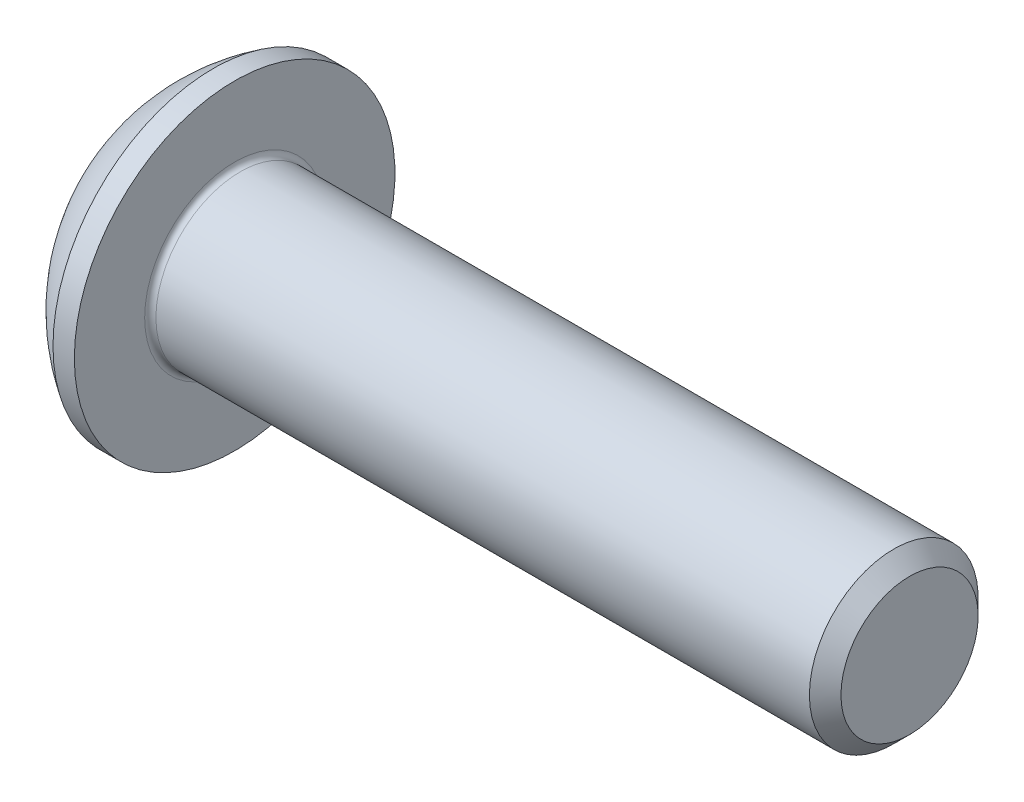
ISO-10303-21;
HEADER;
FILE_DESCRIPTION(('STEP AP214'),'2;1');
FILE_NAME('part.step','',(''),(''),'','','');
FILE_SCHEMA(('AUTOMOTIVE_DESIGN { 1 0 10303 214 1 1 1 1 }'));
ENDSEC;
DATA;
#1=APPLICATION_CONTEXT('core data for automotive mechanical design processes');
#2=APPLICATION_PROTOCOL_DEFINITION('international standard','automotive_design',2000,#1);
#3=PRODUCT_CONTEXT('',#1,'mechanical');
#4=PRODUCT('Part','Part','',(#3));
#5=PRODUCT_RELATED_PRODUCT_CATEGORY('part','',(#4));
#6=PRODUCT_DEFINITION_FORMATION('','',#4);
#7=PRODUCT_DEFINITION_CONTEXT('part definition',#1,'design');
#8=PRODUCT_DEFINITION('design','',#6,#7);
#9=PRODUCT_DEFINITION_SHAPE('','',#8);
#10=(LENGTH_UNIT() NAMED_UNIT(*) SI_UNIT(.MILLI.,.METRE.));
#11=(NAMED_UNIT(*) PLANE_ANGLE_UNIT() SI_UNIT($,.RADIAN.));
#12=(NAMED_UNIT(*) SI_UNIT($,.STERADIAN.) SOLID_ANGLE_UNIT());
#13=UNCERTAINTY_MEASURE_WITH_UNIT(LENGTH_MEASURE(1.E-05),#10,'distance_accuracy_value','');
#14=(GEOMETRIC_REPRESENTATION_CONTEXT(3) GLOBAL_UNCERTAINTY_ASSIGNED_CONTEXT((#13)) GLOBAL_UNIT_ASSIGNED_CONTEXT((#10,
#11,#12)) REPRESENTATION_CONTEXT('',''));
#15=CARTESIAN_POINT('',(0.,0.,0.));
#16=DIRECTION('',(0.,0.,1.));
#17=DIRECTION('',(1.,0.,0.));
#18=AXIS2_PLACEMENT_3D('',#15,#16,#17);
#19=CARTESIAN_POINT('',(0.,0.,0.));
#20=DIRECTION('',(-1.,0.,0.));
#21=DIRECTION('',(0.,0.,1.));
#22=AXIS2_PLACEMENT_3D('',#19,#20,#21);
#23=PLANE('',#22);
#24=CARTESIAN_POINT('',(0.,0.,0.));
#25=DIRECTION('',(-1.,0.,0.));
#26=DIRECTION('',(0.,0.,1.));
#27=AXIS2_PLACEMENT_3D('',#24,#25,#26);
#28=CIRCLE('',#27,1.425);
#29=CARTESIAN_POINT('',(0.,0.,1.425));
#30=VERTEX_POINT('',#29);
#31=EDGE_CURVE('E156',#30,#30,#28,.T.);
#32=ORIENTED_EDGE('',*,*,#31,.T.);
#33=EDGE_LOOP('',(#32));
#34=FACE_BOUND('',#33,.T.);
#35=DIRECTION('',(0.,-1.,0.));
#36=VECTOR('',#35,1.);
#37=CARTESIAN_POINT('',(0.,-0.577350269189625,1.));
#38=LINE('',#37,#36);
#39=CARTESIAN_POINT('',(0.,0.577350269189626,1.));
#40=VERTEX_POINT('',#39);
#41=CARTESIAN_POINT('',(0.,-0.577350269189625,1.));
#42=VERTEX_POINT('',#41);
#43=EDGE_CURVE('E51',#40,#42,#38,.T.);
#44=ORIENTED_EDGE('',*,*,#43,.T.);
#45=DIRECTION('',(0.,-0.5,-0.866025403784438));
#46=VECTOR('',#45,1.);
#47=CARTESIAN_POINT('',(0.,-1.15470053837925,0.));
#48=LINE('',#47,#46);
#49=CARTESIAN_POINT('',(0.,-1.15470053837925,0.));
#50=VERTEX_POINT('',#49);
#51=EDGE_CURVE('E276',#42,#50,#48,.T.);
#52=ORIENTED_EDGE('',*,*,#51,.T.);
#53=DIRECTION('',(0.,0.5,-0.866025403784438));
#54=VECTOR('',#53,1.);
#55=CARTESIAN_POINT('',(0.,-0.577350269189625,-1.));
#56=LINE('',#55,#54);
#57=CARTESIAN_POINT('',(0.,-0.577350269189625,-1.));
#58=VERTEX_POINT('',#57);
#59=EDGE_CURVE('E131',#50,#58,#56,.T.);
#60=ORIENTED_EDGE('',*,*,#59,.T.);
#61=DIRECTION('',(0.,1.,0.));
#62=VECTOR('',#61,1.);
#63=CARTESIAN_POINT('',(0.,0.577350269189626,-1.));
#64=LINE('',#63,#62);
#65=CARTESIAN_POINT('',(0.,0.577350269189626,-1.));
#66=VERTEX_POINT('',#65);
#67=EDGE_CURVE('E279',#58,#66,#64,.T.);
#68=ORIENTED_EDGE('',*,*,#67,.T.);
#69=DIRECTION('',(0.,0.5,0.866025403784439));
#70=VECTOR('',#69,1.);
#71=CARTESIAN_POINT('',(0.,1.15470053837925,0.));
#72=LINE('',#71,#70);
#73=CARTESIAN_POINT('',(0.,1.15470053837925,0.));
#74=VERTEX_POINT('',#73);
#75=EDGE_CURVE('E281',#66,#74,#72,.T.);
#76=ORIENTED_EDGE('',*,*,#75,.T.);
#77=DIRECTION('',(0.,-0.5,0.866025403784439));
#78=VECTOR('',#77,1.);
#79=CARTESIAN_POINT('',(0.,0.577350269189626,1.));
#80=LINE('',#79,#78);
#81=EDGE_CURVE('E283',#74,#40,#80,.T.);
#82=ORIENTED_EDGE('',*,*,#81,.T.);
#83=EDGE_LOOP('',(#44,#52,#60,#68,#76,#82));
#84=FACE_BOUND('',#83,.T.);
#85=ADVANCED_FACE('F36',(#34,#84),#23,.T.);
#86=CARTESIAN_POINT('',(3.03337598425197,0.,0.));
#87=DIRECTION('',(-1.,0.,0.));
#88=DIRECTION('',(0.,1.,0.));
#89=AXIS2_PLACEMENT_3D('',#86,#87,#88);
#90=SPHERICAL_SURFACE('',#89,3.35141684393879);
#91=CARTESIAN_POINT('',(1.27,0.,0.));
#92=DIRECTION('',(-1.,0.,0.));
#93=DIRECTION('',(0.,0.,1.));
#94=AXIS2_PLACEMENT_3D('',#91,#92,#93);
#95=CIRCLE('',#94,2.85);
#96=CARTESIAN_POINT('',(1.27,0.,2.85));
#97=VERTEX_POINT('',#96);
#98=EDGE_CURVE('E153',#97,#97,#95,.T.);
#99=ORIENTED_EDGE('',*,*,#98,.T.);
#100=EDGE_LOOP('',(#99));
#101=FACE_BOUND('',#100,.T.);
#102=ORIENTED_EDGE('',*,*,#31,.F.);
#103=EDGE_LOOP('',(#102));
#104=FACE_BOUND('',#103,.T.);
#105=ADVANCED_FACE('F177',(#101,#104),#90,.T.);
#106=CARTESIAN_POINT('',(0.,0.,0.));
#107=DIRECTION('',(-1.,0.,0.));
#108=DIRECTION('',(0.,0.,1.));
#109=AXIS2_PLACEMENT_3D('',#106,#107,#108);
#110=CYLINDRICAL_SURFACE('',#109,2.85);
#111=ORIENTED_EDGE('',*,*,#98,.F.);
#112=EDGE_LOOP('',(#111));
#113=FACE_BOUND('',#112,.T.);
#114=CARTESIAN_POINT('',(1.65,0.,0.));
#115=DIRECTION('',(-1.,0.,0.));
#116=DIRECTION('',(0.,0.,1.));
#117=AXIS2_PLACEMENT_3D('',#114,#115,#116);
#118=CIRCLE('',#117,2.85);
#119=CARTESIAN_POINT('',(1.65,0.,2.85));
#120=VERTEX_POINT('',#119);
#121=EDGE_CURVE('E150',#120,#120,#118,.T.);
#122=ORIENTED_EDGE('',*,*,#121,.T.);
#123=EDGE_LOOP('',(#122));
#124=FACE_BOUND('',#123,.T.);
#125=ADVANCED_FACE('F182',(#113,#124),#110,.T.);
#126=CARTESIAN_POINT('',(1.65,1.5,0.));
#127=DIRECTION('',(-1.,0.,0.));
#128=DIRECTION('',(0.,0.,1.));
#129=AXIS2_PLACEMENT_3D('',#126,#127,#128);
#130=PLANE('',#129);
#131=CARTESIAN_POINT('',(1.65,0.,0.));
#132=DIRECTION('',(-1.,0.,0.));
#133=DIRECTION('',(0.,0.,1.));
#134=AXIS2_PLACEMENT_3D('',#131,#132,#133);
#135=CIRCLE('',#134,1.6);
#136=CARTESIAN_POINT('',(1.65,0.,1.6));
#137=VERTEX_POINT('',#136);
#138=EDGE_CURVE('E44',#137,#137,#135,.T.);
#139=ORIENTED_EDGE('',*,*,#138,.T.);
#140=EDGE_LOOP('',(#139));
#141=FACE_BOUND('',#140,.T.);
#142=ORIENTED_EDGE('',*,*,#121,.F.);
#143=EDGE_LOOP('',(#142));
#144=FACE_BOUND('',#143,.T.);
#145=ADVANCED_FACE('F161',(#141,#144),#130,.F.);
#146=CARTESIAN_POINT('',(0.,0.,0.));
#147=DIRECTION('',(-1.,0.,0.));
#148=DIRECTION('',(0.,0.,1.));
#149=AXIS2_PLACEMENT_3D('',#146,#147,#148);
#150=CYLINDRICAL_SURFACE('',#149,1.5);
#151=CARTESIAN_POINT('',(1.75,0.,0.));
#152=DIRECTION('',(-1.,0.,0.));
#153=DIRECTION('',(0.,0.,1.));
#154=AXIS2_PLACEMENT_3D('',#151,#152,#153);
#155=CIRCLE('',#154,1.5);
#156=CARTESIAN_POINT('',(1.75,0.,1.5));
#157=VERTEX_POINT('',#156);
#158=EDGE_CURVE('E11',#157,#157,#155,.F.);
#159=ORIENTED_EDGE('',*,*,#158,.T.);
#160=EDGE_LOOP('',(#159));
#161=FACE_BOUND('',#160,.T.);
#162=CARTESIAN_POINT('',(13.3695,0.,0.));
#163=DIRECTION('',(-1.,0.,0.));
#164=DIRECTION('',(0.,0.,1.));
#165=AXIS2_PLACEMENT_3D('',#162,#163,#164);
#166=CIRCLE('',#165,1.5);
#167=CARTESIAN_POINT('',(13.3695,0.,1.5));
#168=VERTEX_POINT('',#167);
#169=EDGE_CURVE('E147',#168,#168,#166,.T.);
#170=ORIENTED_EDGE('',*,*,#169,.T.);
#171=EDGE_LOOP('',(#170));
#172=FACE_BOUND('',#171,.T.);
#173=ADVANCED_FACE('F191',(#161,#172),#150,.T.);
#174=CARTESIAN_POINT('',(13.65,0.,0.));
#175=DIRECTION('',(-1.,0.,0.));
#176=DIRECTION('',(0.,0.,1.));
#177=AXIS2_PLACEMENT_3D('',#174,#175,#176);
#178=CONICAL_SURFACE('',#177,1.2195,0.785398163397436);
#179=ORIENTED_EDGE('',*,*,#169,.F.);
#180=EDGE_LOOP('',(#179));
#181=FACE_BOUND('',#180,.T.);
#182=CARTESIAN_POINT('',(13.65,0.,0.));
#183=DIRECTION('',(-1.,0.,0.));
#184=DIRECTION('',(0.,0.,1.));
#185=AXIS2_PLACEMENT_3D('',#182,#183,#184);
#186=CIRCLE('',#185,1.2195);
#187=CARTESIAN_POINT('',(13.65,0.,1.2195));
#188=VERTEX_POINT('',#187);
#189=EDGE_CURVE('E143',#188,#188,#186,.T.);
#190=ORIENTED_EDGE('',*,*,#189,.T.);
#191=EDGE_LOOP('',(#190));
#192=FACE_BOUND('',#191,.T.);
#193=ADVANCED_FACE('F172',(#181,#192),#178,.T.);
#194=CARTESIAN_POINT('',(13.65,0.,0.));
#195=DIRECTION('',(-1.,0.,0.));
#196=DIRECTION('',(0.,0.,1.));
#197=AXIS2_PLACEMENT_3D('',#194,#195,#196);
#198=PLANE('',#197);
#199=ORIENTED_EDGE('',*,*,#189,.F.);
#200=EDGE_LOOP('',(#199));
#201=FACE_BOUND('',#200,.T.);
#202=ADVANCED_FACE('F165',(#201),#198,.F.);
#203=CARTESIAN_POINT('',(1.75,0.,0.));
#204=DIRECTION('',(-1.,0.,0.));
#205=DIRECTION('',(0.,0.,1.));
#206=AXIS2_PLACEMENT_3D('',#203,#204,#205);
#207=TOROIDAL_SURFACE('',#206,1.6,0.1);
#208=ORIENTED_EDGE('',*,*,#158,.F.);
#209=EDGE_LOOP('',(#208));
#210=FACE_BOUND('',#209,.T.);
#211=ORIENTED_EDGE('',*,*,#138,.F.);
#212=EDGE_LOOP('',(#211));
#213=FACE_BOUND('',#212,.T.);
#214=ADVANCED_FACE('F38',(#210,#213),#207,.F.);
#215=CARTESIAN_POINT('',(1.04,-1.15470053837925,0.));
#216=DIRECTION('',(0.,0.866025403784438,-0.5));
#217=DIRECTION('',(0.,0.5,0.866025403784438));
#218=AXIS2_PLACEMENT_3D('',#215,#216,#217);
#219=PLANE('',#218);
#220=DIRECTION('',(0.,-0.5,-0.866025403784438));
#221=VECTOR('',#220,1.);
#222=CARTESIAN_POINT('',(1.04,-1.15470053837925,0.));
#223=LINE('',#222,#221);
#224=CARTESIAN_POINT('',(1.04,-0.577350269189625,1.));
#225=VERTEX_POINT('',#224);
#226=CARTESIAN_POINT('',(1.04,-0.866025403784438,0.5));
#227=VERTEX_POINT('',#226);
#228=EDGE_CURVE('E117',#225,#227,#223,.T.);
#229=ORIENTED_EDGE('',*,*,#228,.T.);
#230=CARTESIAN_POINT('',(1.04,-1.15470053837925,0.));
#231=VERTEX_POINT('',#230);
#232=EDGE_CURVE('E112',#227,#231,#223,.T.);
#233=ORIENTED_EDGE('',*,*,#232,.T.);
#234=DIRECTION('',(-1.,0.,0.));
#235=VECTOR('',#234,1.);
#236=CARTESIAN_POINT('',(1.04,-1.15470053837925,0.));
#237=LINE('',#236,#235);
#238=EDGE_CURVE('E114',#231,#50,#237,.T.);
#239=ORIENTED_EDGE('',*,*,#238,.T.);
#240=ORIENTED_EDGE('',*,*,#51,.F.);
#241=DIRECTION('',(-1.,0.,0.));
#242=VECTOR('',#241,1.);
#243=CARTESIAN_POINT('',(1.04,-0.577350269189625,1.));
#244=LINE('',#243,#242);
#245=EDGE_CURVE('E272',#225,#42,#244,.T.);
#246=ORIENTED_EDGE('',*,*,#245,.F.);
#247=EDGE_LOOP('',(#229,#233,#239,#240,#246));
#248=FACE_BOUND('',#247,.T.);
#249=ADVANCED_FACE('F113',(#248),#219,.T.);
#250=CARTESIAN_POINT('',(1.04,-0.577350269189625,-1.));
#251=DIRECTION('',(0.,0.866025403784438,0.5));
#252=DIRECTION('',(0.,-0.5,0.866025403784438));
#253=AXIS2_PLACEMENT_3D('',#250,#251,#252);
#254=PLANE('',#253);
#255=DIRECTION('',(0.,0.5,-0.866025403784438));
#256=VECTOR('',#255,1.);
#257=CARTESIAN_POINT('',(1.04,-0.577350269189625,-1.));
#258=LINE('',#257,#256);
#259=CARTESIAN_POINT('',(1.04,-0.866025403784438,-0.5));
#260=VERTEX_POINT('',#259);
#261=EDGE_CURVE('E59',#231,#260,#258,.T.);
#262=ORIENTED_EDGE('',*,*,#261,.T.);
#263=CARTESIAN_POINT('',(1.04,-0.577350269189625,-1.));
#264=VERTEX_POINT('',#263);
#265=EDGE_CURVE('E126',#260,#264,#258,.T.);
#266=ORIENTED_EDGE('',*,*,#265,.T.);
#267=DIRECTION('',(-1.,0.,0.));
#268=VECTOR('',#267,1.);
#269=CARTESIAN_POINT('',(1.04,-0.577350269189625,-1.));
#270=LINE('',#269,#268);
#271=EDGE_CURVE('E133',#264,#58,#270,.T.);
#272=ORIENTED_EDGE('',*,*,#271,.T.);
#273=ORIENTED_EDGE('',*,*,#59,.F.);
#274=ORIENTED_EDGE('',*,*,#238,.F.);
#275=EDGE_LOOP('',(#262,#266,#272,#273,#274));
#276=FACE_BOUND('',#275,.T.);
#277=ADVANCED_FACE('F129',(#276),#254,.T.);
#278=CARTESIAN_POINT('',(1.04,0.577350269189626,-1.));
#279=DIRECTION('',(0.,0.,1.));
#280=DIRECTION('',(1.,0.,0.));
#281=AXIS2_PLACEMENT_3D('',#278,#279,#280);
#282=PLANE('',#281);
#283=DIRECTION('',(0.,1.,0.));
#284=VECTOR('',#283,1.);
#285=CARTESIAN_POINT('',(1.04,0.577350269189626,-1.));
#286=LINE('',#285,#284);
#287=CARTESIAN_POINT('',(1.04,0.,-1.));
#288=VERTEX_POINT('',#287);
#289=EDGE_CURVE('E253',#264,#288,#286,.T.);
#290=ORIENTED_EDGE('',*,*,#289,.T.);
#291=CARTESIAN_POINT('',(1.04,0.577350269189626,-1.));
#292=VERTEX_POINT('',#291);
#293=EDGE_CURVE('E125',#288,#292,#286,.T.);
#294=ORIENTED_EDGE('',*,*,#293,.T.);
#295=DIRECTION('',(-1.,0.,0.));
#296=VECTOR('',#295,1.);
#297=CARTESIAN_POINT('',(1.04,0.577350269189626,-1.));
#298=LINE('',#297,#296);
#299=EDGE_CURVE('E138',#292,#66,#298,.T.);
#300=ORIENTED_EDGE('',*,*,#299,.T.);
#301=ORIENTED_EDGE('',*,*,#67,.F.);
#302=ORIENTED_EDGE('',*,*,#271,.F.);
#303=EDGE_LOOP('',(#290,#294,#300,#301,#302));
#304=FACE_BOUND('',#303,.T.);
#305=ADVANCED_FACE('F205',(#304),#282,.T.);
#306=CARTESIAN_POINT('',(1.04,1.15470053837925,0.));
#307=DIRECTION('',(0.,-0.866025403784439,0.5));
#308=DIRECTION('',(0.,-0.5,-0.866025403784439));
#309=AXIS2_PLACEMENT_3D('',#306,#307,#308);
#310=PLANE('',#309);
#311=DIRECTION('',(0.,0.5,0.866025403784439));
#312=VECTOR('',#311,1.);
#313=CARTESIAN_POINT('',(1.04,1.15470053837925,0.));
#314=LINE('',#313,#312);
#315=CARTESIAN_POINT('',(1.04,0.866025403784439,-0.5));
#316=VERTEX_POINT('',#315);
#317=EDGE_CURVE('E242',#292,#316,#314,.T.);
#318=ORIENTED_EDGE('',*,*,#317,.T.);
#319=CARTESIAN_POINT('',(1.04,1.15470053837925,0.));
#320=VERTEX_POINT('',#319);
#321=EDGE_CURVE('E247',#316,#320,#314,.T.);
#322=ORIENTED_EDGE('',*,*,#321,.T.);
#323=DIRECTION('',(-1.,0.,0.));
#324=VECTOR('',#323,1.);
#325=CARTESIAN_POINT('',(1.04,1.15470053837925,0.));
#326=LINE('',#325,#324);
#327=EDGE_CURVE('E287',#320,#74,#326,.T.);
#328=ORIENTED_EDGE('',*,*,#327,.T.);
#329=ORIENTED_EDGE('',*,*,#75,.F.);
#330=ORIENTED_EDGE('',*,*,#299,.F.);
#331=EDGE_LOOP('',(#318,#322,#328,#329,#330));
#332=FACE_BOUND('',#331,.T.);
#333=ADVANCED_FACE('F208',(#332),#310,.T.);
#334=CARTESIAN_POINT('',(1.04,0.577350269189626,1.));
#335=DIRECTION('',(0.,-0.866025403784439,-0.5));
#336=DIRECTION('',(0.,0.5,-0.866025403784439));
#337=AXIS2_PLACEMENT_3D('',#334,#335,#336);
#338=PLANE('',#337);
#339=DIRECTION('',(0.,-0.5,0.866025403784439));
#340=VECTOR('',#339,1.);
#341=CARTESIAN_POINT('',(1.04,0.577350269189626,1.));
#342=LINE('',#341,#340);
#343=CARTESIAN_POINT('',(1.04,0.866025403784439,0.5));
#344=VERTEX_POINT('',#343);
#345=EDGE_CURVE('E250',#320,#344,#342,.T.);
#346=ORIENTED_EDGE('',*,*,#345,.T.);
#347=CARTESIAN_POINT('',(1.04,0.577350269189626,1.));
#348=VERTEX_POINT('',#347);
#349=EDGE_CURVE('E258',#344,#348,#342,.T.);
#350=ORIENTED_EDGE('',*,*,#349,.T.);
#351=DIRECTION('',(-1.,0.,0.));
#352=VECTOR('',#351,1.);
#353=CARTESIAN_POINT('',(1.04,0.577350269189626,1.));
#354=LINE('',#353,#352);
#355=EDGE_CURVE('E271',#348,#40,#354,.T.);
#356=ORIENTED_EDGE('',*,*,#355,.T.);
#357=ORIENTED_EDGE('',*,*,#81,.F.);
#358=ORIENTED_EDGE('',*,*,#327,.F.);
#359=EDGE_LOOP('',(#346,#350,#356,#357,#358));
#360=FACE_BOUND('',#359,.T.);
#361=ADVANCED_FACE('F212',(#360),#338,.T.);
#362=CARTESIAN_POINT('',(1.04,-0.577350269189625,1.));
#363=DIRECTION('',(0.,0.,-1.));
#364=DIRECTION('',(-1.,0.,0.));
#365=AXIS2_PLACEMENT_3D('',#362,#363,#364);
#366=PLANE('',#365);
#367=DIRECTION('',(0.,-1.,0.));
#368=VECTOR('',#367,1.);
#369=CARTESIAN_POINT('',(1.04,-0.577350269189625,1.));
#370=LINE('',#369,#368);
#371=CARTESIAN_POINT('',(1.04,0.,1.));
#372=VERTEX_POINT('',#371);
#373=EDGE_CURVE('E264',#348,#372,#370,.T.);
#374=ORIENTED_EDGE('',*,*,#373,.T.);
#375=EDGE_CURVE('E266',#372,#225,#370,.T.);
#376=ORIENTED_EDGE('',*,*,#375,.T.);
#377=ORIENTED_EDGE('',*,*,#245,.T.);
#378=ORIENTED_EDGE('',*,*,#43,.F.);
#379=ORIENTED_EDGE('',*,*,#355,.F.);
#380=EDGE_LOOP('',(#374,#376,#377,#378,#379));
#381=FACE_BOUND('',#380,.T.);
#382=ADVANCED_FACE('F216',(#381),#366,.T.);
#383=CARTESIAN_POINT('',(1.04,-1.15470053837925,0.));
#384=DIRECTION('',(1.,0.,0.));
#385=DIRECTION('',(0.,0.,-1.));
#386=AXIS2_PLACEMENT_3D('',#383,#384,#385);
#387=PLANE('',#386);
#388=CARTESIAN_POINT('',(1.04,0.,0.));
#389=DIRECTION('',(-1.,0.,0.));
#390=DIRECTION('',(0.,0.,1.));
#391=AXIS2_PLACEMENT_3D('',#388,#389,#390);
#392=CIRCLE('',#391,1.);
#393=EDGE_CURVE('E239',#316,#288,#392,.T.);
#394=ORIENTED_EDGE('',*,*,#393,.F.);
#395=ORIENTED_EDGE('',*,*,#317,.F.);
#396=ORIENTED_EDGE('',*,*,#293,.F.);
#397=EDGE_LOOP('',(#394,#395,#396));
#398=FACE_BOUND('',#397,.T.);
#399=ADVANCED_FACE('F220',(#398),#387,.F.);
#400=EDGE_CURVE('E144',#344,#316,#392,.T.);
#401=ORIENTED_EDGE('',*,*,#400,.F.);
#402=ORIENTED_EDGE('',*,*,#345,.F.);
#403=ORIENTED_EDGE('',*,*,#321,.F.);
#404=EDGE_LOOP('',(#401,#402,#403));
#405=FACE_BOUND('',#404,.T.);
#406=ADVANCED_FACE('F229',(#405),#387,.F.);
#407=EDGE_CURVE('E137',#372,#344,#392,.T.);
#408=ORIENTED_EDGE('',*,*,#407,.F.);
#409=ORIENTED_EDGE('',*,*,#373,.F.);
#410=ORIENTED_EDGE('',*,*,#349,.F.);
#411=EDGE_LOOP('',(#408,#409,#410));
#412=FACE_BOUND('',#411,.T.);
#413=ADVANCED_FACE('F234',(#412),#387,.F.);
#414=EDGE_CURVE('E132',#227,#372,#392,.T.);
#415=ORIENTED_EDGE('',*,*,#414,.F.);
#416=ORIENTED_EDGE('',*,*,#228,.F.);
#417=ORIENTED_EDGE('',*,*,#375,.F.);
#418=EDGE_LOOP('',(#415,#416,#417));
#419=FACE_BOUND('',#418,.T.);
#420=ADVANCED_FACE('F227',(#419),#387,.F.);
#421=EDGE_CURVE('E123',#260,#227,#392,.T.);
#422=ORIENTED_EDGE('',*,*,#421,.F.);
#423=ORIENTED_EDGE('',*,*,#261,.F.);
#424=ORIENTED_EDGE('',*,*,#232,.F.);
#425=EDGE_LOOP('',(#422,#423,#424));
#426=FACE_BOUND('',#425,.T.);
#427=ADVANCED_FACE('F122',(#426),#387,.F.);
#428=EDGE_CURVE('E245',#288,#260,#392,.T.);
#429=ORIENTED_EDGE('',*,*,#428,.F.);
#430=ORIENTED_EDGE('',*,*,#289,.F.);
#431=ORIENTED_EDGE('',*,*,#265,.F.);
#432=EDGE_LOOP('',(#429,#430,#431));
#433=FACE_BOUND('',#432,.T.);
#434=ADVANCED_FACE('F200',(#433),#387,.F.);
#435=CARTESIAN_POINT('',(1.61735026918963,0.,0.));
#436=DIRECTION('',(-1.,0.,0.));
#437=DIRECTION('',(0.,0.,1.));
#438=AXIS2_PLACEMENT_3D('',#435,#436,#437);
#439=CONICAL_SURFACE('',#438,0.,1.04719755119659);
#440=ORIENTED_EDGE('',*,*,#407,.T.);
#441=ORIENTED_EDGE('',*,*,#400,.T.);
#442=ORIENTED_EDGE('',*,*,#393,.T.);
#443=ORIENTED_EDGE('',*,*,#428,.T.);
#444=ORIENTED_EDGE('',*,*,#421,.T.);
#445=ORIENTED_EDGE('',*,*,#414,.T.);
#446=EDGE_LOOP('',(#440,#441,#442,#443,#444,#445));
#447=FACE_BOUND('',#446,.T.);
#448=CARTESIAN_POINT('',(1.61735026918963,0.,0.));
#449=VERTEX_POINT('',#448);
#450=VERTEX_LOOP('',#449);
#451=FACE_BOUND('',#450,.T.);
#452=ADVANCED_FACE('F198',(#447,#451),#439,.F.);
#453=CLOSED_SHELL('',(#85,#105,#125,#145,#173,#193,#202,#214,#249,#277,#305,#333,#361,#382,#399,
#406,#413,#420,#427,#434,#452));
#454=MANIFOLD_SOLID_BREP('B2',#453);
#455=ADVANCED_BREP_SHAPE_REPRESENTATION('',(#18,#454),#14);
#456=SHAPE_DEFINITION_REPRESENTATION(#9,#455);
ENDSEC;
END-ISO-10303-21;
